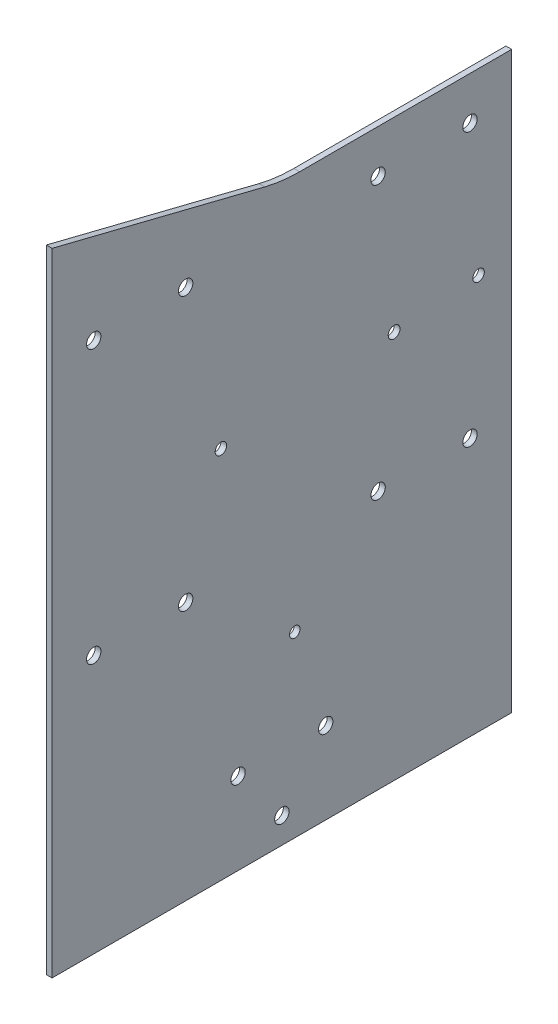
ISO-10303-21;
HEADER;
FILE_DESCRIPTION(('STEP AP214'),'2;1');
FILE_NAME('part.step','',(''),(''),'','','');
FILE_SCHEMA(('AUTOMOTIVE_DESIGN { 1 0 10303 214 1 1 1 1 }'));
ENDSEC;
DATA;
#1=APPLICATION_CONTEXT('core data for automotive mechanical design processes');
#2=APPLICATION_PROTOCOL_DEFINITION('international standard','automotive_design',2000,#1);
#3=PRODUCT_CONTEXT('',#1,'mechanical');
#4=PRODUCT('Part','Part','',(#3));
#5=PRODUCT_RELATED_PRODUCT_CATEGORY('part','',(#4));
#6=PRODUCT_DEFINITION_FORMATION('','',#4);
#7=PRODUCT_DEFINITION_CONTEXT('part definition',#1,'design');
#8=PRODUCT_DEFINITION('design','',#6,#7);
#9=PRODUCT_DEFINITION_SHAPE('','',#8);
#10=(LENGTH_UNIT() NAMED_UNIT(*) SI_UNIT(.MILLI.,.METRE.));
#11=(NAMED_UNIT(*) PLANE_ANGLE_UNIT() SI_UNIT($,.RADIAN.));
#12=(NAMED_UNIT(*) SI_UNIT($,.STERADIAN.) SOLID_ANGLE_UNIT());
#13=UNCERTAINTY_MEASURE_WITH_UNIT(LENGTH_MEASURE(1.E-05),#10,'distance_accuracy_value','');
#14=(GEOMETRIC_REPRESENTATION_CONTEXT(3) GLOBAL_UNCERTAINTY_ASSIGNED_CONTEXT((#13)) GLOBAL_UNIT_ASSIGNED_CONTEXT((#10,
#11,#12)) REPRESENTATION_CONTEXT('',''));
#15=CARTESIAN_POINT('',(0.,0.,0.));
#16=DIRECTION('',(0.,0.,1.));
#17=DIRECTION('',(1.,0.,0.));
#18=AXIS2_PLACEMENT_3D('',#15,#16,#17);
#19=CARTESIAN_POINT('',(2.,150.,-6.15528128088298));
#20=DIRECTION('',(-1.,0.,0.));
#21=DIRECTION('',(0.,0.,1.));
#22=AXIS2_PLACEMENT_3D('',#19,#20,#21);
#23=PLANE('',#22);
#24=CARTESIAN_POINT('',(2.,37.640760233259,-68.4727426625209));
#25=DIRECTION('',(1.,0.,0.));
#26=DIRECTION('',(0.,0.,-1.));
#27=AXIS2_PLACEMENT_3D('',#24,#25,#26);
#28=CIRCLE('',#27,2.00065681072776);
#29=CARTESIAN_POINT('',(2.,37.640760233259,-70.4733994732487));
#30=VERTEX_POINT('',#29);
#31=EDGE_CURVE('E237',#30,#30,#28,.T.);
#32=ORIENTED_EDGE('',*,*,#31,.F.);
#33=EDGE_LOOP('',(#32));
#34=FACE_BOUND('',#33,.T.);
#35=CARTESIAN_POINT('',(2.,35.2034699403506,-39.0735995452795));
#36=DIRECTION('',(1.,0.,0.));
#37=DIRECTION('',(0.,0.,-1.));
#38=AXIS2_PLACEMENT_3D('',#35,#36,#37);
#39=CIRCLE('',#38,2.05440491155169);
#40=CARTESIAN_POINT('',(2.,35.2034699403506,-41.1280044568312));
#41=VERTEX_POINT('',#40);
#42=EDGE_CURVE('E231',#41,#41,#39,.T.);
#43=ORIENTED_EDGE('',*,*,#42,.F.);
#44=EDGE_LOOP('',(#43));
#45=FACE_BOUND('',#44,.T.);
#46=CARTESIAN_POINT('',(2.,30.2049593396664,21.2195583731356));
#47=DIRECTION('',(1.,0.,0.));
#48=DIRECTION('',(0.,0.,-1.));
#49=AXIS2_PLACEMENT_3D('',#46,#47,#48);
#50=CIRCLE('',#49,2.);
#51=CARTESIAN_POINT('',(2.,30.2049593396664,19.2195583731356));
#52=VERTEX_POINT('',#51);
#53=EDGE_CURVE('E225',#52,#52,#50,.T.);
#54=ORIENTED_EDGE('',*,*,#53,.F.);
#55=EDGE_LOOP('',(#54));
#56=FACE_BOUND('',#55,.T.);
#57=CARTESIAN_POINT('',(2.,-37.9033190450464,-4.49546477424779));
#58=DIRECTION('',(1.,0.,0.));
#59=DIRECTION('',(0.,0.,-1.));
#60=AXIS2_PLACEMENT_3D('',#57,#58,#59);
#61=CIRCLE('',#60,1.8475104680008);
#62=CARTESIAN_POINT('',(2.,-37.9033190450464,-6.34297524224858));
#63=VERTEX_POINT('',#62);
#64=EDGE_CURVE('E219',#63,#63,#61,.T.);
#65=ORIENTED_EDGE('',*,*,#64,.F.);
#66=EDGE_LOOP('',(#65));
#67=FACE_BOUND('',#66,.T.);
#68=DIRECTION('',(0.,-1.,0.));
#69=VECTOR('',#68,1.);
#70=CARTESIAN_POINT('',(2.,99.9999999999999,80.));
#71=LINE('',#70,#69);
#72=CARTESIAN_POINT('',(2.,120.,80.));
#73=VERTEX_POINT('',#72);
#74=CARTESIAN_POINT('',(2.,-100.,80.));
#75=VERTEX_POINT('',#74);
#76=EDGE_CURVE('E88',#73,#75,#71,.T.);
#77=ORIENTED_EDGE('',*,*,#76,.T.);
#78=DIRECTION('',(0.,0.,-1.));
#79=VECTOR('',#78,1.);
#80=CARTESIAN_POINT('',(2.,-100.,-80.));
#81=LINE('',#80,#79);
#82=CARTESIAN_POINT('',(2.,-100.,-80.));
#83=VERTEX_POINT('',#82);
#84=EDGE_CURVE('E149',#75,#83,#81,.T.);
#85=ORIENTED_EDGE('',*,*,#84,.T.);
#86=DIRECTION('',(0.,1.,0.));
#87=VECTOR('',#86,1.);
#88=CARTESIAN_POINT('',(2.,-100.,-80.));
#89=LINE('',#88,#87);
#90=CARTESIAN_POINT('',(2.,100.,-80.));
#91=VERTEX_POINT('',#90);
#92=EDGE_CURVE('E103',#83,#91,#89,.T.);
#93=ORIENTED_EDGE('',*,*,#92,.T.);
#94=DIRECTION('',(0.,0.,1.));
#95=VECTOR('',#94,1.);
#96=CARTESIAN_POINT('',(2.,100.,-80.));
#97=LINE('',#96,#95);
#98=CARTESIAN_POINT('',(2.,100.,-6.15528128088299));
#99=VERTEX_POINT('',#98);
#100=EDGE_CURVE('E96',#91,#99,#97,.T.);
#101=ORIENTED_EDGE('',*,*,#100,.T.);
#102=CARTESIAN_POINT('',(2.,150.,-6.15528128088298));
#103=DIRECTION('',(-1.,0.,0.));
#104=DIRECTION('',(0.,0.,1.));
#105=AXIS2_PLACEMENT_3D('',#102,#103,#104);
#106=CIRCLE('',#105,50.);
#107=CARTESIAN_POINT('',(2.,101.492874992733,5.97149997093358));
#108=VERTEX_POINT('',#107);
#109=EDGE_CURVE('E100',#99,#108,#106,.T.);
#110=ORIENTED_EDGE('',*,*,#109,.T.);
#111=DIRECTION('',(0.,0.242535625036332,0.970142500145332));
#112=VECTOR('',#111,1.);
#113=CARTESIAN_POINT('',(2.,119.378732187482,77.5149287499273));
#114=LINE('',#113,#112);
#115=EDGE_CURVE('E55',#108,#73,#114,.T.);
#116=ORIENTED_EDGE('',*,*,#115,.T.);
#117=EDGE_LOOP('',(#77,#85,#93,#101,#110,#116));
#118=FACE_BOUND('',#117,.T.);
#119=CARTESIAN_POINT('',(2.,-91.0000000000001,0.));
#120=DIRECTION('',(1.,0.,0.));
#121=DIRECTION('',(0.,0.,-1.));
#122=AXIS2_PLACEMENT_3D('',#119,#120,#121);
#123=CIRCLE('',#122,2.5);
#124=CARTESIAN_POINT('',(2.,-91.0000000000001,-2.50000000000001));
#125=VERTEX_POINT('',#124);
#126=EDGE_CURVE('E126',#125,#125,#123,.T.);
#127=ORIENTED_EDGE('',*,*,#126,.F.);
#128=EDGE_LOOP('',(#127));
#129=FACE_BOUND('',#128,.T.);
#130=CARTESIAN_POINT('',(2.,-71.5,15.2500000000001));
#131=DIRECTION('',(1.,0.,0.));
#132=DIRECTION('',(0.,0.,-1.));
#133=AXIS2_PLACEMENT_3D('',#130,#131,#132);
#134=CIRCLE('',#133,2.5);
#135=CARTESIAN_POINT('',(2.,-71.5,12.7500000000001));
#136=VERTEX_POINT('',#135);
#137=EDGE_CURVE('E156',#136,#136,#134,.T.);
#138=ORIENTED_EDGE('',*,*,#137,.F.);
#139=EDGE_LOOP('',(#138));
#140=FACE_BOUND('',#139,.T.);
#141=CARTESIAN_POINT('',(2.,-10.,65.5));
#142=DIRECTION('',(1.,0.,0.));
#143=DIRECTION('',(0.,0.,-1.));
#144=AXIS2_PLACEMENT_3D('',#141,#142,#143);
#145=CIRCLE('',#144,2.49999999999999);
#146=CARTESIAN_POINT('',(2.,-10.,63.));
#147=VERTEX_POINT('',#146);
#148=EDGE_CURVE('E162',#147,#147,#145,.T.);
#149=ORIENTED_EDGE('',*,*,#148,.F.);
#150=EDGE_LOOP('',(#149));
#151=FACE_BOUND('',#150,.T.);
#152=CARTESIAN_POINT('',(2.,-10.,33.5));
#153=DIRECTION('',(1.,0.,0.));
#154=DIRECTION('',(0.,0.,-1.));
#155=AXIS2_PLACEMENT_3D('',#152,#153,#154);
#156=CIRCLE('',#155,2.5);
#157=CARTESIAN_POINT('',(2.,-10.,31.));
#158=VERTEX_POINT('',#157);
#159=EDGE_CURVE('E168',#158,#158,#156,.T.);
#160=ORIENTED_EDGE('',*,*,#159,.F.);
#161=EDGE_LOOP('',(#160));
#162=FACE_BOUND('',#161,.T.);
#163=CARTESIAN_POINT('',(2.,85.,65.5000000000003));
#164=DIRECTION('',(1.,0.,0.));
#165=DIRECTION('',(0.,0.,-1.));
#166=AXIS2_PLACEMENT_3D('',#163,#164,#165);
#167=CIRCLE('',#166,2.5);
#168=CARTESIAN_POINT('',(2.,85.,63.0000000000003));
#169=VERTEX_POINT('',#168);
#170=EDGE_CURVE('E174',#169,#169,#167,.T.);
#171=ORIENTED_EDGE('',*,*,#170,.F.);
#172=EDGE_LOOP('',(#171));
#173=FACE_BOUND('',#172,.T.);
#174=CARTESIAN_POINT('',(2.,85.,33.5000000000003));
#175=DIRECTION('',(1.,0.,0.));
#176=DIRECTION('',(0.,0.,-1.));
#177=AXIS2_PLACEMENT_3D('',#174,#175,#176);
#178=CIRCLE('',#177,2.5);
#179=CARTESIAN_POINT('',(2.,85.,31.0000000000003));
#180=VERTEX_POINT('',#179);
#181=EDGE_CURVE('E180',#180,#180,#178,.T.);
#182=ORIENTED_EDGE('',*,*,#181,.F.);
#183=EDGE_LOOP('',(#182));
#184=FACE_BOUND('',#183,.T.);
#185=CARTESIAN_POINT('',(2.,-71.4999999999712,-15.2499999999999));
#186=DIRECTION('',(1.,0.,0.));
#187=DIRECTION('',(0.,0.,-1.));
#188=AXIS2_PLACEMENT_3D('',#185,#186,#187);
#189=CIRCLE('',#188,2.4999999999999);
#190=CARTESIAN_POINT('',(2.,-71.4999999999712,-17.7499999999998));
#191=VERTEX_POINT('',#190);
#192=EDGE_CURVE('E186',#191,#191,#189,.T.);
#193=ORIENTED_EDGE('',*,*,#192,.F.);
#194=EDGE_LOOP('',(#193));
#195=FACE_BOUND('',#194,.T.);
#196=CARTESIAN_POINT('',(2.,85.,-33.5000000000003));
#197=DIRECTION('',(1.,0.,0.));
#198=DIRECTION('',(0.,0.,1.));
#199=AXIS2_PLACEMENT_3D('',#196,#197,#198);
#200=CIRCLE('',#199,2.5);
#201=CARTESIAN_POINT('',(2.,85.,-31.0000000000003));
#202=VERTEX_POINT('',#201);
#203=EDGE_CURVE('E192',#202,#202,#200,.T.);
#204=ORIENTED_EDGE('',*,*,#203,.F.);
#205=EDGE_LOOP('',(#204));
#206=FACE_BOUND('',#205,.T.);
#207=CARTESIAN_POINT('',(2.,85.,-65.5000000000003));
#208=DIRECTION('',(1.,0.,0.));
#209=DIRECTION('',(0.,0.,1.));
#210=AXIS2_PLACEMENT_3D('',#207,#208,#209);
#211=CIRCLE('',#210,2.5);
#212=CARTESIAN_POINT('',(2.,85.,-63.0000000000003));
#213=VERTEX_POINT('',#212);
#214=EDGE_CURVE('E198',#213,#213,#211,.T.);
#215=ORIENTED_EDGE('',*,*,#214,.F.);
#216=EDGE_LOOP('',(#215));
#217=FACE_BOUND('',#216,.T.);
#218=CARTESIAN_POINT('',(2.,-10.,-33.5));
#219=DIRECTION('',(1.,0.,0.));
#220=DIRECTION('',(0.,0.,1.));
#221=AXIS2_PLACEMENT_3D('',#218,#219,#220);
#222=CIRCLE('',#221,2.5);
#223=CARTESIAN_POINT('',(2.,-10.,-31.));
#224=VERTEX_POINT('',#223);
#225=EDGE_CURVE('E204',#224,#224,#222,.T.);
#226=ORIENTED_EDGE('',*,*,#225,.F.);
#227=EDGE_LOOP('',(#226));
#228=FACE_BOUND('',#227,.T.);
#229=CARTESIAN_POINT('',(2.,-10.,-65.5));
#230=DIRECTION('',(1.,0.,0.));
#231=DIRECTION('',(0.,0.,1.));
#232=AXIS2_PLACEMENT_3D('',#229,#230,#231);
#233=CIRCLE('',#232,2.49999999999999);
#234=CARTESIAN_POINT('',(2.,-10.,-63.));
#235=VERTEX_POINT('',#234);
#236=EDGE_CURVE('E210',#235,#235,#233,.T.);
#237=ORIENTED_EDGE('',*,*,#236,.F.);
#238=EDGE_LOOP('',(#237));
#239=FACE_BOUND('',#238,.T.);
#240=ADVANCED_FACE('F38',(#34,#45,#56,#67,#118,#129,#140,#151,#162,#173,#184,#195,#206,#217,
#228,#239),#23,.F.);
#241=CARTESIAN_POINT('',(0.,150.,-6.15528128088298));
#242=DIRECTION('',(-1.,0.,0.));
#243=DIRECTION('',(0.,0.,1.));
#244=AXIS2_PLACEMENT_3D('',#241,#242,#243);
#245=PLANE('',#244);
#246=CARTESIAN_POINT('',(0.,37.640760233259,-68.4727426625209));
#247=DIRECTION('',(1.,0.,0.));
#248=DIRECTION('',(0.,0.,-1.));
#249=AXIS2_PLACEMENT_3D('',#246,#247,#248);
#250=CIRCLE('',#249,2.00065681072776);
#251=CARTESIAN_POINT('',(0.,37.640760233259,-70.4733994732487));
#252=VERTEX_POINT('',#251);
#253=EDGE_CURVE('E216',#252,#252,#250,.T.);
#254=ORIENTED_EDGE('',*,*,#253,.T.);
#255=EDGE_LOOP('',(#254));
#256=FACE_BOUND('',#255,.T.);
#257=CARTESIAN_POINT('',(0.,35.2034699403506,-39.0735995452795));
#258=DIRECTION('',(1.,0.,0.));
#259=DIRECTION('',(0.,0.,-1.));
#260=AXIS2_PLACEMENT_3D('',#257,#258,#259);
#261=CIRCLE('',#260,2.05440491155169);
#262=CARTESIAN_POINT('',(0.,35.2034699403506,-41.1280044568312));
#263=VERTEX_POINT('',#262);
#264=EDGE_CURVE('E234',#263,#263,#261,.T.);
#265=ORIENTED_EDGE('',*,*,#264,.T.);
#266=EDGE_LOOP('',(#265));
#267=FACE_BOUND('',#266,.T.);
#268=CARTESIAN_POINT('',(0.,30.2049593396664,21.2195583731356));
#269=DIRECTION('',(1.,0.,0.));
#270=DIRECTION('',(0.,0.,-1.));
#271=AXIS2_PLACEMENT_3D('',#268,#269,#270);
#272=CIRCLE('',#271,2.);
#273=CARTESIAN_POINT('',(0.,30.2049593396664,19.2195583731356));
#274=VERTEX_POINT('',#273);
#275=EDGE_CURVE('E228',#274,#274,#272,.T.);
#276=ORIENTED_EDGE('',*,*,#275,.T.);
#277=EDGE_LOOP('',(#276));
#278=FACE_BOUND('',#277,.T.);
#279=CARTESIAN_POINT('',(0.,-37.9033190450464,-4.49546477424779));
#280=DIRECTION('',(1.,0.,0.));
#281=DIRECTION('',(0.,0.,-1.));
#282=AXIS2_PLACEMENT_3D('',#279,#280,#281);
#283=CIRCLE('',#282,1.8475104680008);
#284=CARTESIAN_POINT('',(0.,-37.9033190450464,-6.34297524224858));
#285=VERTEX_POINT('',#284);
#286=EDGE_CURVE('E222',#285,#285,#283,.T.);
#287=ORIENTED_EDGE('',*,*,#286,.T.);
#288=EDGE_LOOP('',(#287));
#289=FACE_BOUND('',#288,.T.);
#290=CARTESIAN_POINT('',(0.,-10.,-33.5));
#291=DIRECTION('',(1.,0.,0.));
#292=DIRECTION('',(0.,0.,1.));
#293=AXIS2_PLACEMENT_3D('',#290,#291,#292);
#294=CIRCLE('',#293,2.5);
#295=CARTESIAN_POINT('',(0.,-10.,-31.));
#296=VERTEX_POINT('',#295);
#297=EDGE_CURVE('E207',#296,#296,#294,.T.);
#298=ORIENTED_EDGE('',*,*,#297,.T.);
#299=EDGE_LOOP('',(#298));
#300=FACE_BOUND('',#299,.T.);
#301=CARTESIAN_POINT('',(0.,85.,-33.5000000000003));
#302=DIRECTION('',(1.,0.,0.));
#303=DIRECTION('',(0.,0.,1.));
#304=AXIS2_PLACEMENT_3D('',#301,#302,#303);
#305=CIRCLE('',#304,2.5);
#306=CARTESIAN_POINT('',(0.,85.,-31.0000000000003));
#307=VERTEX_POINT('',#306);
#308=EDGE_CURVE('E195',#307,#307,#305,.T.);
#309=ORIENTED_EDGE('',*,*,#308,.T.);
#310=EDGE_LOOP('',(#309));
#311=FACE_BOUND('',#310,.T.);
#312=CARTESIAN_POINT('',(0.,85.,33.5000000000003));
#313=DIRECTION('',(1.,0.,0.));
#314=DIRECTION('',(0.,0.,-1.));
#315=AXIS2_PLACEMENT_3D('',#312,#313,#314);
#316=CIRCLE('',#315,2.5);
#317=CARTESIAN_POINT('',(0.,85.,31.0000000000003));
#318=VERTEX_POINT('',#317);
#319=EDGE_CURVE('E183',#318,#318,#316,.T.);
#320=ORIENTED_EDGE('',*,*,#319,.T.);
#321=EDGE_LOOP('',(#320));
#322=FACE_BOUND('',#321,.T.);
#323=CARTESIAN_POINT('',(0.,-10.,33.5));
#324=DIRECTION('',(1.,0.,0.));
#325=DIRECTION('',(0.,0.,-1.));
#326=AXIS2_PLACEMENT_3D('',#323,#324,#325);
#327=CIRCLE('',#326,2.5);
#328=CARTESIAN_POINT('',(0.,-10.,31.));
#329=VERTEX_POINT('',#328);
#330=EDGE_CURVE('E171',#329,#329,#327,.T.);
#331=ORIENTED_EDGE('',*,*,#330,.T.);
#332=EDGE_LOOP('',(#331));
#333=FACE_BOUND('',#332,.T.);
#334=CARTESIAN_POINT('',(0.,-71.5,15.2500000000001));
#335=DIRECTION('',(1.,0.,0.));
#336=DIRECTION('',(0.,0.,-1.));
#337=AXIS2_PLACEMENT_3D('',#334,#335,#336);
#338=CIRCLE('',#337,2.5);
#339=CARTESIAN_POINT('',(0.,-71.5,12.7500000000001));
#340=VERTEX_POINT('',#339);
#341=EDGE_CURVE('E159',#340,#340,#338,.T.);
#342=ORIENTED_EDGE('',*,*,#341,.T.);
#343=EDGE_LOOP('',(#342));
#344=FACE_BOUND('',#343,.T.);
#345=DIRECTION('',(0.,0.,-1.));
#346=VECTOR('',#345,1.);
#347=CARTESIAN_POINT('',(0.,-100.,-80.));
#348=LINE('',#347,#346);
#349=CARTESIAN_POINT('',(0.,-100.,80.));
#350=VERTEX_POINT('',#349);
#351=CARTESIAN_POINT('',(0.,-100.,-80.));
#352=VERTEX_POINT('',#351);
#353=EDGE_CURVE('E123',#350,#352,#348,.T.);
#354=ORIENTED_EDGE('',*,*,#353,.F.);
#355=DIRECTION('',(0.,-1.,0.));
#356=VECTOR('',#355,1.);
#357=CARTESIAN_POINT('',(0.,120.,80.));
#358=LINE('',#357,#356);
#359=CARTESIAN_POINT('',(0.,120.,80.));
#360=VERTEX_POINT('',#359);
#361=EDGE_CURVE('E132',#360,#350,#358,.T.);
#362=ORIENTED_EDGE('',*,*,#361,.F.);
#363=DIRECTION('',(0.,0.24253562503633,0.970142500145333));
#364=VECTOR('',#363,1.);
#365=CARTESIAN_POINT('',(0.,119.378732187482,77.5149287499273));
#366=LINE('',#365,#364);
#367=CARTESIAN_POINT('',(0.,101.492874992733,5.97149997093358));
#368=VERTEX_POINT('',#367);
#369=EDGE_CURVE('E78',#368,#360,#366,.T.);
#370=ORIENTED_EDGE('',*,*,#369,.F.);
#371=CARTESIAN_POINT('',(0.,150.,-6.15528128088298));
#372=DIRECTION('',(-1.,0.,0.));
#373=DIRECTION('',(0.,0.,1.));
#374=AXIS2_PLACEMENT_3D('',#371,#372,#373);
#375=CIRCLE('',#374,50.);
#376=CARTESIAN_POINT('',(0.,100.,-6.15528128088299));
#377=VERTEX_POINT('',#376);
#378=EDGE_CURVE('E129',#377,#368,#375,.T.);
#379=ORIENTED_EDGE('',*,*,#378,.F.);
#380=DIRECTION('',(0.,0.,1.));
#381=VECTOR('',#380,1.);
#382=CARTESIAN_POINT('',(0.,100.,-80.));
#383=LINE('',#382,#381);
#384=CARTESIAN_POINT('',(0.,100.,-80.));
#385=VERTEX_POINT('',#384);
#386=EDGE_CURVE('E112',#385,#377,#383,.T.);
#387=ORIENTED_EDGE('',*,*,#386,.F.);
#388=DIRECTION('',(0.,1.,0.));
#389=VECTOR('',#388,1.);
#390=CARTESIAN_POINT('',(0.,-100.,-80.));
#391=LINE('',#390,#389);
#392=EDGE_CURVE('E125',#352,#385,#391,.T.);
#393=ORIENTED_EDGE('',*,*,#392,.F.);
#394=EDGE_LOOP('',(#354,#362,#370,#379,#387,#393));
#395=FACE_BOUND('',#394,.T.);
#396=CARTESIAN_POINT('',(0.,-91.0000000000001,0.));
#397=DIRECTION('',(1.,0.,0.));
#398=DIRECTION('',(0.,0.,-1.));
#399=AXIS2_PLACEMENT_3D('',#396,#397,#398);
#400=CIRCLE('',#399,2.5);
#401=CARTESIAN_POINT('',(0.,-91.0000000000001,-2.50000000000001));
#402=VERTEX_POINT('',#401);
#403=EDGE_CURVE('E153',#402,#402,#400,.T.);
#404=ORIENTED_EDGE('',*,*,#403,.T.);
#405=EDGE_LOOP('',(#404));
#406=FACE_BOUND('',#405,.T.);
#407=CARTESIAN_POINT('',(0.,-10.,65.5));
#408=DIRECTION('',(1.,0.,0.));
#409=DIRECTION('',(0.,0.,-1.));
#410=AXIS2_PLACEMENT_3D('',#407,#408,#409);
#411=CIRCLE('',#410,2.49999999999999);
#412=CARTESIAN_POINT('',(0.,-10.,63.));
#413=VERTEX_POINT('',#412);
#414=EDGE_CURVE('E165',#413,#413,#411,.T.);
#415=ORIENTED_EDGE('',*,*,#414,.T.);
#416=EDGE_LOOP('',(#415));
#417=FACE_BOUND('',#416,.T.);
#418=CARTESIAN_POINT('',(0.,85.,65.5000000000003));
#419=DIRECTION('',(1.,0.,0.));
#420=DIRECTION('',(0.,0.,-1.));
#421=AXIS2_PLACEMENT_3D('',#418,#419,#420);
#422=CIRCLE('',#421,2.5);
#423=CARTESIAN_POINT('',(0.,85.,63.0000000000003));
#424=VERTEX_POINT('',#423);
#425=EDGE_CURVE('E177',#424,#424,#422,.T.);
#426=ORIENTED_EDGE('',*,*,#425,.T.);
#427=EDGE_LOOP('',(#426));
#428=FACE_BOUND('',#427,.T.);
#429=CARTESIAN_POINT('',(0.,-71.4999999999712,-15.2499999999999));
#430=DIRECTION('',(1.,0.,0.));
#431=DIRECTION('',(0.,0.,-1.));
#432=AXIS2_PLACEMENT_3D('',#429,#430,#431);
#433=CIRCLE('',#432,2.4999999999999);
#434=CARTESIAN_POINT('',(0.,-71.4999999999712,-17.7499999999998));
#435=VERTEX_POINT('',#434);
#436=EDGE_CURVE('E189',#435,#435,#433,.T.);
#437=ORIENTED_EDGE('',*,*,#436,.T.);
#438=EDGE_LOOP('',(#437));
#439=FACE_BOUND('',#438,.T.);
#440=CARTESIAN_POINT('',(0.,85.,-65.5000000000003));
#441=DIRECTION('',(1.,0.,0.));
#442=DIRECTION('',(0.,0.,1.));
#443=AXIS2_PLACEMENT_3D('',#440,#441,#442);
#444=CIRCLE('',#443,2.5);
#445=CARTESIAN_POINT('',(0.,85.,-63.0000000000003));
#446=VERTEX_POINT('',#445);
#447=EDGE_CURVE('E201',#446,#446,#444,.T.);
#448=ORIENTED_EDGE('',*,*,#447,.T.);
#449=EDGE_LOOP('',(#448));
#450=FACE_BOUND('',#449,.T.);
#451=CARTESIAN_POINT('',(0.,-10.,-65.5));
#452=DIRECTION('',(1.,0.,0.));
#453=DIRECTION('',(0.,0.,1.));
#454=AXIS2_PLACEMENT_3D('',#451,#452,#453);
#455=CIRCLE('',#454,2.49999999999999);
#456=CARTESIAN_POINT('',(0.,-10.,-63.));
#457=VERTEX_POINT('',#456);
#458=EDGE_CURVE('E213',#457,#457,#455,.T.);
#459=ORIENTED_EDGE('',*,*,#458,.T.);
#460=EDGE_LOOP('',(#459));
#461=FACE_BOUND('',#460,.T.);
#462=ADVANCED_FACE('F144',(#256,#267,#278,#289,#300,#311,#322,#333,#344,#395,#406,#417,#428,
#439,#450,#461),#245,.T.);
#463=CARTESIAN_POINT('',(2.,-100.,-80.));
#464=DIRECTION('',(0.,1.,0.));
#465=DIRECTION('',(0.,0.,1.));
#466=AXIS2_PLACEMENT_3D('',#463,#464,#465);
#467=PLANE('',#466);
#468=ORIENTED_EDGE('',*,*,#353,.T.);
#469=DIRECTION('',(-1.,0.,0.));
#470=VECTOR('',#469,1.);
#471=CARTESIAN_POINT('',(2.,-100.,-80.));
#472=LINE('',#471,#470);
#473=EDGE_CURVE('E47',#83,#352,#472,.T.);
#474=ORIENTED_EDGE('',*,*,#473,.F.);
#475=ORIENTED_EDGE('',*,*,#84,.F.);
#476=DIRECTION('',(-1.,0.,0.));
#477=VECTOR('',#476,1.);
#478=CARTESIAN_POINT('',(2.,-100.,80.));
#479=LINE('',#478,#477);
#480=EDGE_CURVE('E11',#75,#350,#479,.T.);
#481=ORIENTED_EDGE('',*,*,#480,.T.);
#482=EDGE_LOOP('',(#468,#474,#475,#481));
#483=FACE_BOUND('',#482,.T.);
#484=ADVANCED_FACE('F40',(#483),#467,.F.);
#485=CARTESIAN_POINT('',(2.,-100.,-80.));
#486=DIRECTION('',(0.,0.,1.));
#487=DIRECTION('',(0.,-1.,0.));
#488=AXIS2_PLACEMENT_3D('',#485,#486,#487);
#489=PLANE('',#488);
#490=ORIENTED_EDGE('',*,*,#392,.T.);
#491=DIRECTION('',(-1.,0.,0.));
#492=VECTOR('',#491,1.);
#493=CARTESIAN_POINT('',(2.,100.,-80.));
#494=LINE('',#493,#492);
#495=EDGE_CURVE('E114',#91,#385,#494,.T.);
#496=ORIENTED_EDGE('',*,*,#495,.F.);
#497=ORIENTED_EDGE('',*,*,#92,.F.);
#498=ORIENTED_EDGE('',*,*,#473,.T.);
#499=EDGE_LOOP('',(#490,#496,#497,#498));
#500=FACE_BOUND('',#499,.T.);
#501=ADVANCED_FACE('F140',(#500),#489,.F.);
#502=CARTESIAN_POINT('',(2.,100.,-80.));
#503=DIRECTION('',(0.,-1.,0.));
#504=DIRECTION('',(0.,0.,-1.));
#505=AXIS2_PLACEMENT_3D('',#502,#503,#504);
#506=PLANE('',#505);
#507=ORIENTED_EDGE('',*,*,#386,.T.);
#508=DIRECTION('',(-1.,0.,0.));
#509=VECTOR('',#508,1.);
#510=CARTESIAN_POINT('',(2.,100.,-6.15528128088299));
#511=LINE('',#510,#509);
#512=EDGE_CURVE('E109',#99,#377,#511,.T.);
#513=ORIENTED_EDGE('',*,*,#512,.F.);
#514=ORIENTED_EDGE('',*,*,#100,.F.);
#515=ORIENTED_EDGE('',*,*,#495,.T.);
#516=EDGE_LOOP('',(#507,#513,#514,#515));
#517=FACE_BOUND('',#516,.T.);
#518=ADVANCED_FACE('F110',(#517),#506,.F.);
#519=CARTESIAN_POINT('',(2.,150.,-6.15528128088298));
#520=DIRECTION('',(-1.,0.,0.));
#521=DIRECTION('',(0.,0.,1.));
#522=AXIS2_PLACEMENT_3D('',#519,#520,#521);
#523=CYLINDRICAL_SURFACE('',#522,50.);
#524=ORIENTED_EDGE('',*,*,#378,.T.);
#525=DIRECTION('',(-1.,0.,0.));
#526=VECTOR('',#525,1.);
#527=CARTESIAN_POINT('',(2.,101.492874992733,5.97149997093358));
#528=LINE('',#527,#526);
#529=EDGE_CURVE('E115',#108,#368,#528,.T.);
#530=ORIENTED_EDGE('',*,*,#529,.F.);
#531=ORIENTED_EDGE('',*,*,#109,.F.);
#532=ORIENTED_EDGE('',*,*,#512,.T.);
#533=EDGE_LOOP('',(#524,#530,#531,#532));
#534=FACE_BOUND('',#533,.T.);
#535=ADVANCED_FACE('F117',(#534),#523,.F.);
#536=CARTESIAN_POINT('',(2.,119.378732187482,77.5149287499273));
#537=DIRECTION('',(0.,-0.970142500145333,0.24253562503633));
#538=DIRECTION('',(0.,-0.24253562503633,-0.970142500145333));
#539=AXIS2_PLACEMENT_3D('',#536,#537,#538);
#540=PLANE('',#539);
#541=ORIENTED_EDGE('',*,*,#369,.T.);
#542=DIRECTION('',(-1.,0.,0.));
#543=VECTOR('',#542,1.);
#544=CARTESIAN_POINT('',(2.,120.,80.));
#545=LINE('',#544,#543);
#546=EDGE_CURVE('E119',#73,#360,#545,.T.);
#547=ORIENTED_EDGE('',*,*,#546,.F.);
#548=ORIENTED_EDGE('',*,*,#115,.F.);
#549=ORIENTED_EDGE('',*,*,#529,.T.);
#550=EDGE_LOOP('',(#541,#547,#548,#549));
#551=FACE_BOUND('',#550,.T.);
#552=ADVANCED_FACE('F146',(#551),#540,.F.);
#553=CARTESIAN_POINT('',(2.,120.,80.));
#554=DIRECTION('',(0.,0.,-1.));
#555=DIRECTION('',(-1.,0.,0.));
#556=AXIS2_PLACEMENT_3D('',#553,#554,#555);
#557=PLANE('',#556);
#558=ORIENTED_EDGE('',*,*,#361,.T.);
#559=ORIENTED_EDGE('',*,*,#480,.F.);
#560=ORIENTED_EDGE('',*,*,#76,.F.);
#561=ORIENTED_EDGE('',*,*,#546,.T.);
#562=EDGE_LOOP('',(#558,#559,#560,#561));
#563=FACE_BOUND('',#562,.T.);
#564=ADVANCED_FACE('F148',(#563),#557,.F.);
#565=CARTESIAN_POINT('',(2.,-91.0000000000001,0.));
#566=DIRECTION('',(-1.,0.,0.));
#567=DIRECTION('',(0.,0.,1.));
#568=AXIS2_PLACEMENT_3D('',#565,#566,#567);
#569=CYLINDRICAL_SURFACE('',#568,2.5);
#570=ORIENTED_EDGE('',*,*,#126,.T.);
#571=EDGE_LOOP('',(#570));
#572=FACE_BOUND('',#571,.T.);
#573=ORIENTED_EDGE('',*,*,#403,.F.);
#574=EDGE_LOOP('',(#573));
#575=FACE_BOUND('',#574,.T.);
#576=ADVANCED_FACE('F313',(#572,#575),#569,.F.);
#577=CARTESIAN_POINT('',(2.,-71.5,15.2500000000001));
#578=DIRECTION('',(-1.,0.,0.));
#579=DIRECTION('',(0.,0.,1.));
#580=AXIS2_PLACEMENT_3D('',#577,#578,#579);
#581=CYLINDRICAL_SURFACE('',#580,2.5);
#582=ORIENTED_EDGE('',*,*,#137,.T.);
#583=EDGE_LOOP('',(#582));
#584=FACE_BOUND('',#583,.T.);
#585=ORIENTED_EDGE('',*,*,#341,.F.);
#586=EDGE_LOOP('',(#585));
#587=FACE_BOUND('',#586,.T.);
#588=ADVANCED_FACE('F309',(#584,#587),#581,.F.);
#589=CARTESIAN_POINT('',(2.,-10.,65.5));
#590=DIRECTION('',(-1.,0.,0.));
#591=DIRECTION('',(0.,0.,1.));
#592=AXIS2_PLACEMENT_3D('',#589,#590,#591);
#593=CYLINDRICAL_SURFACE('',#592,2.49999999999999);
#594=ORIENTED_EDGE('',*,*,#148,.T.);
#595=EDGE_LOOP('',(#594));
#596=FACE_BOUND('',#595,.T.);
#597=ORIENTED_EDGE('',*,*,#414,.F.);
#598=EDGE_LOOP('',(#597));
#599=FACE_BOUND('',#598,.T.);
#600=ADVANCED_FACE('F305',(#596,#599),#593,.F.);
#601=CARTESIAN_POINT('',(2.,-10.,33.5));
#602=DIRECTION('',(-1.,0.,0.));
#603=DIRECTION('',(0.,0.,1.));
#604=AXIS2_PLACEMENT_3D('',#601,#602,#603);
#605=CYLINDRICAL_SURFACE('',#604,2.5);
#606=ORIENTED_EDGE('',*,*,#159,.T.);
#607=EDGE_LOOP('',(#606));
#608=FACE_BOUND('',#607,.T.);
#609=ORIENTED_EDGE('',*,*,#330,.F.);
#610=EDGE_LOOP('',(#609));
#611=FACE_BOUND('',#610,.T.);
#612=ADVANCED_FACE('F301',(#608,#611),#605,.F.);
#613=CARTESIAN_POINT('',(2.,85.,65.5000000000003));
#614=DIRECTION('',(-1.,0.,0.));
#615=DIRECTION('',(0.,0.,1.));
#616=AXIS2_PLACEMENT_3D('',#613,#614,#615);
#617=CYLINDRICAL_SURFACE('',#616,2.5);
#618=ORIENTED_EDGE('',*,*,#170,.T.);
#619=EDGE_LOOP('',(#618));
#620=FACE_BOUND('',#619,.T.);
#621=ORIENTED_EDGE('',*,*,#425,.F.);
#622=EDGE_LOOP('',(#621));
#623=FACE_BOUND('',#622,.T.);
#624=ADVANCED_FACE('F297',(#620,#623),#617,.F.);
#625=CARTESIAN_POINT('',(2.,85.,33.5000000000003));
#626=DIRECTION('',(-1.,0.,0.));
#627=DIRECTION('',(0.,0.,1.));
#628=AXIS2_PLACEMENT_3D('',#625,#626,#627);
#629=CYLINDRICAL_SURFACE('',#628,2.5);
#630=ORIENTED_EDGE('',*,*,#181,.T.);
#631=EDGE_LOOP('',(#630));
#632=FACE_BOUND('',#631,.T.);
#633=ORIENTED_EDGE('',*,*,#319,.F.);
#634=EDGE_LOOP('',(#633));
#635=FACE_BOUND('',#634,.T.);
#636=ADVANCED_FACE('F293',(#632,#635),#629,.F.);
#637=CARTESIAN_POINT('',(2.,-71.4999999999712,-15.2499999999999));
#638=DIRECTION('',(-1.,0.,0.));
#639=DIRECTION('',(0.,0.,1.));
#640=AXIS2_PLACEMENT_3D('',#637,#638,#639);
#641=CYLINDRICAL_SURFACE('',#640,2.4999999999999);
#642=ORIENTED_EDGE('',*,*,#192,.T.);
#643=EDGE_LOOP('',(#642));
#644=FACE_BOUND('',#643,.T.);
#645=ORIENTED_EDGE('',*,*,#436,.F.);
#646=EDGE_LOOP('',(#645));
#647=FACE_BOUND('',#646,.T.);
#648=ADVANCED_FACE('F289',(#644,#647),#641,.F.);
#649=CARTESIAN_POINT('',(2.,85.,-33.5000000000003));
#650=DIRECTION('',(-1.,0.,0.));
#651=DIRECTION('',(0.,0.,1.));
#652=AXIS2_PLACEMENT_3D('',#649,#650,#651);
#653=CYLINDRICAL_SURFACE('',#652,2.5);
#654=ORIENTED_EDGE('',*,*,#203,.T.);
#655=EDGE_LOOP('',(#654));
#656=FACE_BOUND('',#655,.T.);
#657=ORIENTED_EDGE('',*,*,#308,.F.);
#658=EDGE_LOOP('',(#657));
#659=FACE_BOUND('',#658,.T.);
#660=ADVANCED_FACE('F285',(#656,#659),#653,.F.);
#661=CARTESIAN_POINT('',(2.,85.,-65.5000000000003));
#662=DIRECTION('',(-1.,0.,0.));
#663=DIRECTION('',(0.,0.,1.));
#664=AXIS2_PLACEMENT_3D('',#661,#662,#663);
#665=CYLINDRICAL_SURFACE('',#664,2.5);
#666=ORIENTED_EDGE('',*,*,#214,.T.);
#667=EDGE_LOOP('',(#666));
#668=FACE_BOUND('',#667,.T.);
#669=ORIENTED_EDGE('',*,*,#447,.F.);
#670=EDGE_LOOP('',(#669));
#671=FACE_BOUND('',#670,.T.);
#672=ADVANCED_FACE('F281',(#668,#671),#665,.F.);
#673=CARTESIAN_POINT('',(2.,-10.,-33.5));
#674=DIRECTION('',(-1.,0.,0.));
#675=DIRECTION('',(0.,0.,1.));
#676=AXIS2_PLACEMENT_3D('',#673,#674,#675);
#677=CYLINDRICAL_SURFACE('',#676,2.5);
#678=ORIENTED_EDGE('',*,*,#225,.T.);
#679=EDGE_LOOP('',(#678));
#680=FACE_BOUND('',#679,.T.);
#681=ORIENTED_EDGE('',*,*,#297,.F.);
#682=EDGE_LOOP('',(#681));
#683=FACE_BOUND('',#682,.T.);
#684=ADVANCED_FACE('F273',(#680,#683),#677,.F.);
#685=CARTESIAN_POINT('',(2.,-10.,-65.5));
#686=DIRECTION('',(-1.,0.,0.));
#687=DIRECTION('',(0.,0.,1.));
#688=AXIS2_PLACEMENT_3D('',#685,#686,#687);
#689=CYLINDRICAL_SURFACE('',#688,2.49999999999999);
#690=ORIENTED_EDGE('',*,*,#236,.T.);
#691=EDGE_LOOP('',(#690));
#692=FACE_BOUND('',#691,.T.);
#693=ORIENTED_EDGE('',*,*,#458,.F.);
#694=EDGE_LOOP('',(#693));
#695=FACE_BOUND('',#694,.T.);
#696=ADVANCED_FACE('F264',(#692,#695),#689,.F.);
#697=CARTESIAN_POINT('',(0.,-37.9033190450464,-4.49546477424779));
#698=DIRECTION('',(1.,0.,0.));
#699=DIRECTION('',(0.,0.,-1.));
#700=AXIS2_PLACEMENT_3D('',#697,#698,#699);
#701=CYLINDRICAL_SURFACE('',#700,1.8475104680008);
#702=ORIENTED_EDGE('',*,*,#286,.F.);
#703=EDGE_LOOP('',(#702));
#704=FACE_BOUND('',#703,.T.);
#705=ORIENTED_EDGE('',*,*,#64,.T.);
#706=EDGE_LOOP('',(#705));
#707=FACE_BOUND('',#706,.T.);
#708=ADVANCED_FACE('F261',(#704,#707),#701,.F.);
#709=CARTESIAN_POINT('',(0.,30.2049593396664,21.2195583731356));
#710=DIRECTION('',(1.,0.,0.));
#711=DIRECTION('',(0.,0.,-1.));
#712=AXIS2_PLACEMENT_3D('',#709,#710,#711);
#713=CYLINDRICAL_SURFACE('',#712,2.);
#714=ORIENTED_EDGE('',*,*,#275,.F.);
#715=EDGE_LOOP('',(#714));
#716=FACE_BOUND('',#715,.T.);
#717=ORIENTED_EDGE('',*,*,#53,.T.);
#718=EDGE_LOOP('',(#717));
#719=FACE_BOUND('',#718,.T.);
#720=ADVANCED_FACE('F263',(#716,#719),#713,.F.);
#721=CARTESIAN_POINT('',(0.,35.2034699403506,-39.0735995452795));
#722=DIRECTION('',(1.,0.,0.));
#723=DIRECTION('',(0.,0.,-1.));
#724=AXIS2_PLACEMENT_3D('',#721,#722,#723);
#725=CYLINDRICAL_SURFACE('',#724,2.05440491155169);
#726=ORIENTED_EDGE('',*,*,#264,.F.);
#727=EDGE_LOOP('',(#726));
#728=FACE_BOUND('',#727,.T.);
#729=ORIENTED_EDGE('',*,*,#42,.T.);
#730=EDGE_LOOP('',(#729));
#731=FACE_BOUND('',#730,.T.);
#732=ADVANCED_FACE('F248',(#728,#731),#725,.F.);
#733=CARTESIAN_POINT('',(0.,37.640760233259,-68.4727426625209));
#734=DIRECTION('',(1.,0.,0.));
#735=DIRECTION('',(0.,0.,-1.));
#736=AXIS2_PLACEMENT_3D('',#733,#734,#735);
#737=CYLINDRICAL_SURFACE('',#736,2.00065681072776);
#738=ORIENTED_EDGE('',*,*,#253,.F.);
#739=EDGE_LOOP('',(#738));
#740=FACE_BOUND('',#739,.T.);
#741=ORIENTED_EDGE('',*,*,#31,.T.);
#742=EDGE_LOOP('',(#741));
#743=FACE_BOUND('',#742,.T.);
#744=ADVANCED_FACE('F245',(#740,#743),#737,.F.);
#745=CLOSED_SHELL('',(#240,#462,#484,#501,#518,#535,#552,#564,#576,#588,#600,#612,#624,#636,
#648,#660,#672,#684,#696,#708,#720,#732,#744));
#746=MANIFOLD_SOLID_BREP('B2',#745);
#747=ADVANCED_BREP_SHAPE_REPRESENTATION('',(#18,#746),#14);
#748=SHAPE_DEFINITION_REPRESENTATION(#9,#747);
ENDSEC;
END-ISO-10303-21;
